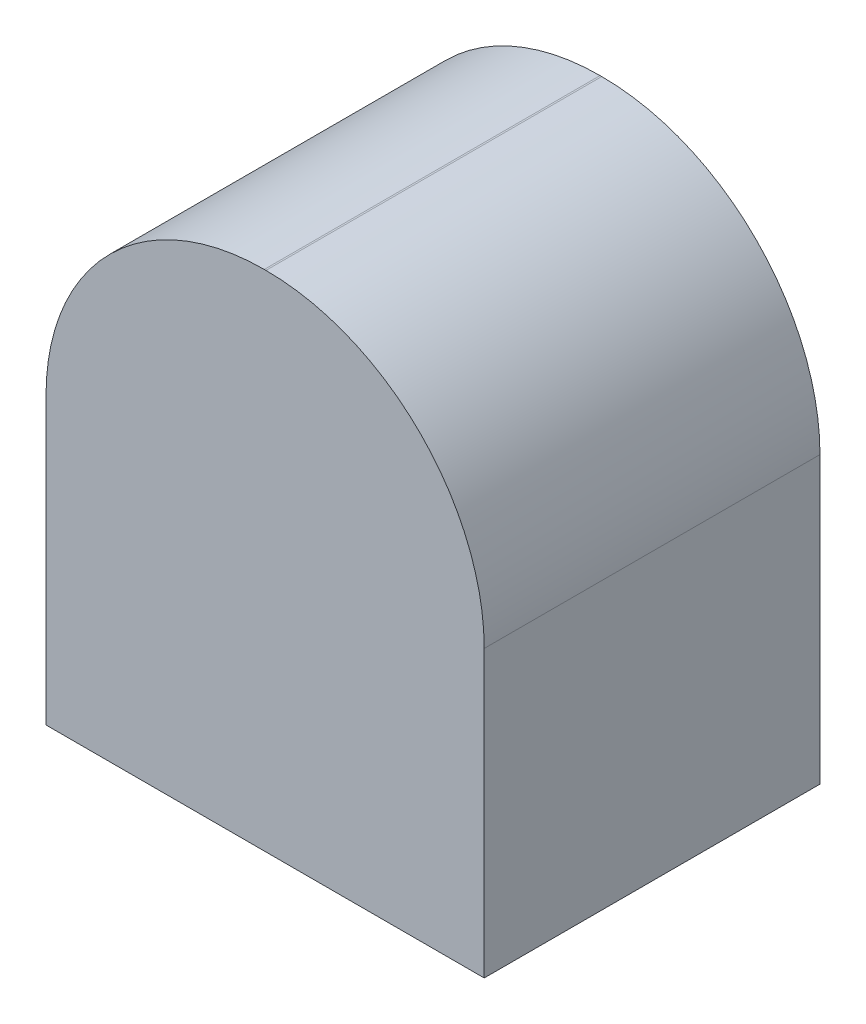
ISO-10303-21;
HEADER;
FILE_DESCRIPTION(('STEP AP214'),'2;1');
FILE_NAME('part.step','',(''),(''),'','','');
FILE_SCHEMA(('AUTOMOTIVE_DESIGN { 1 0 10303 214 1 1 1 1 }'));
ENDSEC;
DATA;
#1=APPLICATION_CONTEXT('core data for automotive mechanical design processes');
#2=APPLICATION_PROTOCOL_DEFINITION('international standard','automotive_design',2000,#1);
#3=PRODUCT_CONTEXT('',#1,'mechanical');
#4=PRODUCT('Part','Part','',(#3));
#5=PRODUCT_RELATED_PRODUCT_CATEGORY('part','',(#4));
#6=PRODUCT_DEFINITION_FORMATION('','',#4);
#7=PRODUCT_DEFINITION_CONTEXT('part definition',#1,'design');
#8=PRODUCT_DEFINITION('design','',#6,#7);
#9=PRODUCT_DEFINITION_SHAPE('','',#8);
#10=(LENGTH_UNIT() NAMED_UNIT(*) SI_UNIT(.MILLI.,.METRE.));
#11=(NAMED_UNIT(*) PLANE_ANGLE_UNIT() SI_UNIT($,.RADIAN.));
#12=(NAMED_UNIT(*) SI_UNIT($,.STERADIAN.) SOLID_ANGLE_UNIT());
#13=UNCERTAINTY_MEASURE_WITH_UNIT(LENGTH_MEASURE(1.E-05),#10,'distance_accuracy_value','');
#14=(GEOMETRIC_REPRESENTATION_CONTEXT(3) GLOBAL_UNCERTAINTY_ASSIGNED_CONTEXT((#13)) GLOBAL_UNIT_ASSIGNED_CONTEXT((#10,
#11,#12)) REPRESENTATION_CONTEXT('',''));
#15=CARTESIAN_POINT('',(0.,0.,0.));
#16=DIRECTION('',(0.,0.,1.));
#17=DIRECTION('',(1.,0.,0.));
#18=AXIS2_PLACEMENT_3D('',#15,#16,#17);
#19=CARTESIAN_POINT('',(-0.13050012,0.,0.1999996));
#20=DIRECTION('',(0.,0.,-1.));
#21=DIRECTION('',(-1.,0.,0.));
#22=AXIS2_PLACEMENT_3D('',#19,#20,#21);
#23=PLANE('',#22);
#24=DIRECTION('',(1.,0.,0.));
#25=VECTOR('',#24,1.);
#26=CARTESIAN_POINT('',(0.13050012,0.2999994,0.1999996));
#27=LINE('',#26,#25);
#28=CARTESIAN_POINT('',(-0.000500119999999997,0.2999994,0.1999996));
#29=VERTEX_POINT('',#28);
#30=CARTESIAN_POINT('',(0.000500120000000007,0.2999994,0.1999996));
#31=VERTEX_POINT('',#30);
#32=EDGE_CURVE('E11',#29,#31,#27,.T.);
#33=ORIENTED_EDGE('',*,*,#32,.F.);
#34=CARTESIAN_POINT('',(-0.00050012,0.1699994,0.1999996));
#35=DIRECTION('',(0.,0.,-1.));
#36=DIRECTION('',(1.,0.,0.));
#37=AXIS2_PLACEMENT_3D('',#34,#35,#36);
#38=CIRCLE('',#37,0.13);
#39=CARTESIAN_POINT('',(-0.13050012,0.1699994,0.1999996));
#40=VERTEX_POINT('',#39);
#41=EDGE_CURVE('E24',#40,#29,#38,.T.);
#42=ORIENTED_EDGE('',*,*,#41,.F.);
#43=DIRECTION('',(0.,1.,0.));
#44=VECTOR('',#43,1.);
#45=CARTESIAN_POINT('',(-0.13050012,0.,0.1999996));
#46=LINE('',#45,#44);
#47=CARTESIAN_POINT('',(-0.13050012,0.,0.1999996));
#48=VERTEX_POINT('',#47);
#49=EDGE_CURVE('E117',#48,#40,#46,.T.);
#50=ORIENTED_EDGE('',*,*,#49,.F.);
#51=DIRECTION('',(-1.,0.,0.));
#52=VECTOR('',#51,1.);
#53=CARTESIAN_POINT('',(-0.13050012,0.,0.1999996));
#54=LINE('',#53,#52);
#55=CARTESIAN_POINT('',(0.13050012,0.,0.1999996));
#56=VERTEX_POINT('',#55);
#57=EDGE_CURVE('E115',#56,#48,#54,.T.);
#58=ORIENTED_EDGE('',*,*,#57,.F.);
#59=DIRECTION('',(0.,-1.,0.));
#60=VECTOR('',#59,1.);
#61=CARTESIAN_POINT('',(0.13050012,0.,0.1999996));
#62=LINE('',#61,#60);
#63=CARTESIAN_POINT('',(0.13050012,0.1699994,0.1999996));
#64=VERTEX_POINT('',#63);
#65=EDGE_CURVE('E73',#64,#56,#62,.T.);
#66=ORIENTED_EDGE('',*,*,#65,.F.);
#67=CARTESIAN_POINT('',(0.00050012,0.1699994,0.1999996));
#68=DIRECTION('',(0.,0.,-1.));
#69=DIRECTION('',(1.,0.,0.));
#70=AXIS2_PLACEMENT_3D('',#67,#68,#69);
#71=CIRCLE('',#70,0.13);
#72=EDGE_CURVE('E111',#31,#64,#71,.T.);
#73=ORIENTED_EDGE('',*,*,#72,.F.);
#74=EDGE_LOOP('',(#33,#42,#50,#58,#66,#73));
#75=FACE_BOUND('',#74,.T.);
#76=ADVANCED_FACE('F17',(#75),#23,.F.);
#77=CARTESIAN_POINT('',(0.00050012,0.1699994,0.));
#78=DIRECTION('',(0.,0.,1.));
#79=DIRECTION('',(1.,0.,0.));
#80=AXIS2_PLACEMENT_3D('',#77,#78,#79);
#81=CYLINDRICAL_SURFACE('',#80,0.13);
#82=ORIENTED_EDGE('',*,*,#72,.T.);
#83=DIRECTION('',(0.,0.,-1.));
#84=VECTOR('',#83,1.);
#85=CARTESIAN_POINT('',(0.13050012,0.1699994,0.));
#86=LINE('',#85,#84);
#87=CARTESIAN_POINT('',(0.13050012,0.1699994,0.));
#88=VERTEX_POINT('',#87);
#89=EDGE_CURVE('E109',#64,#88,#86,.T.);
#90=ORIENTED_EDGE('',*,*,#89,.T.);
#91=CARTESIAN_POINT('',(0.00050012,0.1699994,0.));
#92=DIRECTION('',(0.,0.,1.));
#93=DIRECTION('',(1.,0.,0.));
#94=AXIS2_PLACEMENT_3D('',#91,#92,#93);
#95=CIRCLE('',#94,0.13);
#96=CARTESIAN_POINT('',(0.000500120000000007,0.2999994,0.));
#97=VERTEX_POINT('',#96);
#98=EDGE_CURVE('E89',#88,#97,#95,.T.);
#99=ORIENTED_EDGE('',*,*,#98,.T.);
#100=DIRECTION('',(0.,0.,1.));
#101=VECTOR('',#100,1.);
#102=CARTESIAN_POINT('',(0.000500120000000008,0.2999994,0.));
#103=LINE('',#102,#101);
#104=EDGE_CURVE('E105',#97,#31,#103,.T.);
#105=ORIENTED_EDGE('',*,*,#104,.T.);
#106=EDGE_LOOP('',(#82,#90,#99,#105));
#107=FACE_BOUND('',#106,.T.);
#108=ADVANCED_FACE('F127',(#107),#81,.T.);
#109=CARTESIAN_POINT('',(0.13050012,0.2999994,0.));
#110=DIRECTION('',(0.,-1.,0.));
#111=DIRECTION('',(0.,0.,-1.));
#112=AXIS2_PLACEMENT_3D('',#109,#110,#111);
#113=PLANE('',#112);
#114=DIRECTION('',(1.,0.,0.));
#115=VECTOR('',#114,1.);
#116=CARTESIAN_POINT('',(-0.13050012,0.2999994,0.));
#117=LINE('',#116,#115);
#118=CARTESIAN_POINT('',(-0.000500119999999997,0.2999994,0.));
#119=VERTEX_POINT('',#118);
#120=EDGE_CURVE('E103',#119,#97,#117,.T.);
#121=ORIENTED_EDGE('',*,*,#120,.F.);
#122=DIRECTION('',(0.,0.,-1.));
#123=VECTOR('',#122,1.);
#124=CARTESIAN_POINT('',(-0.000500119999999993,0.2999994,0.));
#125=LINE('',#124,#123);
#126=EDGE_CURVE('E100',#29,#119,#125,.T.);
#127=ORIENTED_EDGE('',*,*,#126,.F.);
#128=ORIENTED_EDGE('',*,*,#32,.T.);
#129=ORIENTED_EDGE('',*,*,#104,.F.);
#130=EDGE_LOOP('',(#121,#127,#128,#129));
#131=FACE_BOUND('',#130,.T.);
#132=ADVANCED_FACE('F123',(#131),#113,.F.);
#133=CARTESIAN_POINT('',(-0.00050012,0.1699994,0.));
#134=DIRECTION('',(0.,0.,1.));
#135=DIRECTION('',(1.,0.,0.));
#136=AXIS2_PLACEMENT_3D('',#133,#134,#135);
#137=CYLINDRICAL_SURFACE('',#136,0.13);
#138=ORIENTED_EDGE('',*,*,#41,.T.);
#139=ORIENTED_EDGE('',*,*,#126,.T.);
#140=CARTESIAN_POINT('',(-0.00050012,0.1699994,0.));
#141=DIRECTION('',(0.,0.,1.));
#142=DIRECTION('',(1.,0.,0.));
#143=AXIS2_PLACEMENT_3D('',#140,#141,#142);
#144=CIRCLE('',#143,0.13);
#145=CARTESIAN_POINT('',(-0.13050012,0.1699994,0.));
#146=VERTEX_POINT('',#145);
#147=EDGE_CURVE('E98',#119,#146,#144,.T.);
#148=ORIENTED_EDGE('',*,*,#147,.T.);
#149=DIRECTION('',(0.,0.,1.));
#150=VECTOR('',#149,1.);
#151=CARTESIAN_POINT('',(-0.13050012,0.1699994,0.));
#152=LINE('',#151,#150);
#153=EDGE_CURVE('E95',#146,#40,#152,.T.);
#154=ORIENTED_EDGE('',*,*,#153,.T.);
#155=EDGE_LOOP('',(#138,#139,#148,#154));
#156=FACE_BOUND('',#155,.T.);
#157=ADVANCED_FACE('F120',(#156),#137,.T.);
#158=CARTESIAN_POINT('',(-0.13050012,0.2999994,0.));
#159=DIRECTION('',(1.,0.,0.));
#160=DIRECTION('',(0.,0.,-1.));
#161=AXIS2_PLACEMENT_3D('',#158,#159,#160);
#162=PLANE('',#161);
#163=DIRECTION('',(0.,1.,0.));
#164=VECTOR('',#163,1.);
#165=CARTESIAN_POINT('',(-0.13050012,0.2999994,0.));
#166=LINE('',#165,#164);
#167=CARTESIAN_POINT('',(-0.13050012,0.,0.));
#168=VERTEX_POINT('',#167);
#169=EDGE_CURVE('E93',#168,#146,#166,.T.);
#170=ORIENTED_EDGE('',*,*,#169,.F.);
#171=DIRECTION('',(0.,0.,-1.));
#172=VECTOR('',#171,1.);
#173=CARTESIAN_POINT('',(-0.13050012,0.,0.));
#174=LINE('',#173,#172);
#175=EDGE_CURVE('E76',#48,#168,#174,.T.);
#176=ORIENTED_EDGE('',*,*,#175,.F.);
#177=ORIENTED_EDGE('',*,*,#49,.T.);
#178=ORIENTED_EDGE('',*,*,#153,.F.);
#179=EDGE_LOOP('',(#170,#176,#177,#178));
#180=FACE_BOUND('',#179,.T.);
#181=ADVANCED_FACE('F125',(#180),#162,.F.);
#182=CARTESIAN_POINT('',(-0.13050012,0.,0.));
#183=DIRECTION('',(0.,1.,0.));
#184=DIRECTION('',(0.,0.,1.));
#185=AXIS2_PLACEMENT_3D('',#182,#183,#184);
#186=PLANE('',#185);
#187=DIRECTION('',(0.,0.,-1.));
#188=VECTOR('',#187,1.);
#189=CARTESIAN_POINT('',(0.13050012,0.,0.));
#190=LINE('',#189,#188);
#191=CARTESIAN_POINT('',(0.13050012,0.,0.));
#192=VERTEX_POINT('',#191);
#193=EDGE_CURVE('E67',#56,#192,#190,.T.);
#194=ORIENTED_EDGE('',*,*,#193,.F.);
#195=ORIENTED_EDGE('',*,*,#57,.T.);
#196=ORIENTED_EDGE('',*,*,#175,.T.);
#197=DIRECTION('',(-1.,0.,0.));
#198=VECTOR('',#197,1.);
#199=CARTESIAN_POINT('',(-0.13050012,0.,0.));
#200=LINE('',#199,#198);
#201=EDGE_CURVE('E77',#192,#168,#200,.T.);
#202=ORIENTED_EDGE('',*,*,#201,.F.);
#203=EDGE_LOOP('',(#194,#195,#196,#202));
#204=FACE_BOUND('',#203,.T.);
#205=ADVANCED_FACE('F81',(#204),#186,.F.);
#206=CARTESIAN_POINT('',(0.13050012,0.,0.));
#207=DIRECTION('',(-1.,0.,0.));
#208=DIRECTION('',(0.,0.,1.));
#209=AXIS2_PLACEMENT_3D('',#206,#207,#208);
#210=PLANE('',#209);
#211=DIRECTION('',(0.,-1.,0.));
#212=VECTOR('',#211,1.);
#213=CARTESIAN_POINT('',(0.13050012,0.,0.));
#214=LINE('',#213,#212);
#215=EDGE_CURVE('E72',#88,#192,#214,.T.);
#216=ORIENTED_EDGE('',*,*,#215,.F.);
#217=ORIENTED_EDGE('',*,*,#89,.F.);
#218=ORIENTED_EDGE('',*,*,#65,.T.);
#219=ORIENTED_EDGE('',*,*,#193,.T.);
#220=EDGE_LOOP('',(#216,#217,#218,#219));
#221=FACE_BOUND('',#220,.T.);
#222=ADVANCED_FACE('F69',(#221),#210,.F.);
#223=CARTESIAN_POINT('',(-0.13050012,0.,0.));
#224=DIRECTION('',(0.,0.,-1.));
#225=DIRECTION('',(-1.,0.,0.));
#226=AXIS2_PLACEMENT_3D('',#223,#224,#225);
#227=PLANE('',#226);
#228=ORIENTED_EDGE('',*,*,#120,.T.);
#229=ORIENTED_EDGE('',*,*,#98,.F.);
#230=ORIENTED_EDGE('',*,*,#215,.T.);
#231=ORIENTED_EDGE('',*,*,#201,.T.);
#232=ORIENTED_EDGE('',*,*,#169,.T.);
#233=ORIENTED_EDGE('',*,*,#147,.F.);
#234=EDGE_LOOP('',(#228,#229,#230,#231,#232,#233));
#235=FACE_BOUND('',#234,.T.);
#236=ADVANCED_FACE('F88',(#235),#227,.T.);
#237=CLOSED_SHELL('',(#76,#108,#132,#157,#181,#205,#222,#236));
#238=MANIFOLD_SOLID_BREP('B1',#237);
#239=ADVANCED_BREP_SHAPE_REPRESENTATION('',(#18,#238),#14);
#240=SHAPE_DEFINITION_REPRESENTATION(#9,#239);
ENDSEC;
END-ISO-10303-21;
